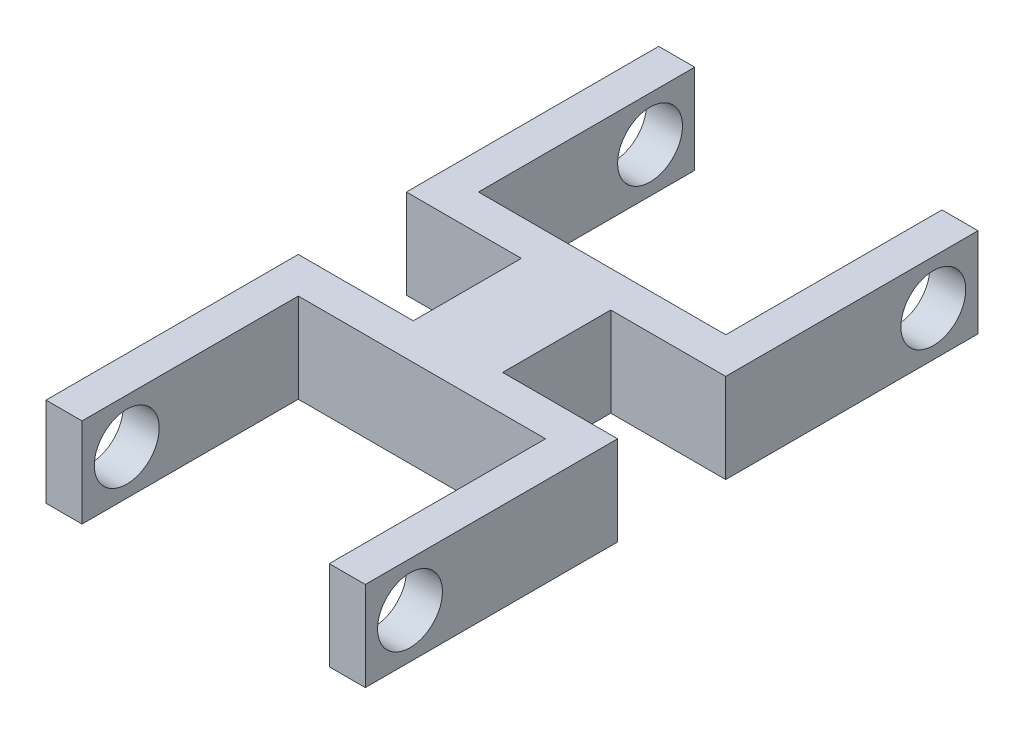
ISO-10303-21;
HEADER;
FILE_DESCRIPTION(('STEP AP214'),'2;1');
FILE_NAME('part.step','',(''),(''),'','','');
FILE_SCHEMA(('AUTOMOTIVE_DESIGN { 1 0 10303 214 1 1 1 1 }'));
ENDSEC;
DATA;
#1=APPLICATION_CONTEXT('core data for automotive mechanical design processes');
#2=APPLICATION_PROTOCOL_DEFINITION('international standard','automotive_design',2000,#1);
#3=PRODUCT_CONTEXT('',#1,'mechanical');
#4=PRODUCT('Part','Part','',(#3));
#5=PRODUCT_RELATED_PRODUCT_CATEGORY('part','',(#4));
#6=PRODUCT_DEFINITION_FORMATION('','',#4);
#7=PRODUCT_DEFINITION_CONTEXT('part definition',#1,'design');
#8=PRODUCT_DEFINITION('design','',#6,#7);
#9=PRODUCT_DEFINITION_SHAPE('','',#8);
#10=(LENGTH_UNIT() NAMED_UNIT(*) SI_UNIT(.MILLI.,.METRE.));
#11=(NAMED_UNIT(*) PLANE_ANGLE_UNIT() SI_UNIT($,.RADIAN.));
#12=(NAMED_UNIT(*) SI_UNIT($,.STERADIAN.) SOLID_ANGLE_UNIT());
#13=UNCERTAINTY_MEASURE_WITH_UNIT(LENGTH_MEASURE(1.E-05),#10,'distance_accuracy_value','');
#14=(GEOMETRIC_REPRESENTATION_CONTEXT(3) GLOBAL_UNCERTAINTY_ASSIGNED_CONTEXT((#13)) GLOBAL_UNIT_ASSIGNED_CONTEXT((#10,
#11,#12)) REPRESENTATION_CONTEXT('',''));
#15=CARTESIAN_POINT('',(0.,0.,0.));
#16=DIRECTION('',(0.,0.,1.));
#17=DIRECTION('',(1.,0.,0.));
#18=AXIS2_PLACEMENT_3D('',#15,#16,#17);
#19=CARTESIAN_POINT('',(0.,0.,-20.));
#20=DIRECTION('',(0.,0.,1.));
#21=DIRECTION('',(1.,0.,0.));
#22=AXIS2_PLACEMENT_3D('',#19,#20,#21);
#23=PLANE('',#22);
#24=DIRECTION('',(0.,-1.,0.));
#25=VECTOR('',#24,1.);
#26=CARTESIAN_POINT('',(-17.15,6.2,-20.));
#27=LINE('',#26,#25);
#28=CARTESIAN_POINT('',(-17.15,6.2,-20.));
#29=VERTEX_POINT('',#28);
#30=CARTESIAN_POINT('',(-17.15,-6.2,-20.));
#31=VERTEX_POINT('',#30);
#32=EDGE_CURVE('E55',#29,#31,#27,.T.);
#33=ORIENTED_EDGE('',*,*,#32,.F.);
#34=DIRECTION('',(1.,0.,0.));
#35=VECTOR('',#34,1.);
#36=CARTESIAN_POINT('',(22.15,6.2,-20.));
#37=LINE('',#36,#35);
#38=CARTESIAN_POINT('',(17.15,6.2,-20.));
#39=VERTEX_POINT('',#38);
#40=EDGE_CURVE('E234',#29,#39,#37,.T.);
#41=ORIENTED_EDGE('',*,*,#40,.T.);
#42=DIRECTION('',(0.,1.,0.));
#43=VECTOR('',#42,1.);
#44=CARTESIAN_POINT('',(17.15,6.2,-20.));
#45=LINE('',#44,#43);
#46=CARTESIAN_POINT('',(17.15,-6.2,-20.));
#47=VERTEX_POINT('',#46);
#48=EDGE_CURVE('E215',#47,#39,#45,.T.);
#49=ORIENTED_EDGE('',*,*,#48,.F.);
#50=DIRECTION('',(-1.,0.,0.));
#51=VECTOR('',#50,1.);
#52=CARTESIAN_POINT('',(22.15,-6.2,-20.));
#53=LINE('',#52,#51);
#54=EDGE_CURVE('E60',#47,#31,#53,.T.);
#55=ORIENTED_EDGE('',*,*,#54,.T.);
#56=EDGE_LOOP('',(#33,#41,#49,#55));
#57=FACE_BOUND('',#56,.T.);
#58=ADVANCED_FACE('F38',(#57),#23,.F.);
#59=CARTESIAN_POINT('',(0.,0.,0.));
#60=DIRECTION('',(0.,0.,1.));
#61=DIRECTION('',(1.,0.,0.));
#62=AXIS2_PLACEMENT_3D('',#59,#60,#61);
#63=PLANE('',#62);
#64=DIRECTION('',(0.,1.,0.));
#65=VECTOR('',#64,1.);
#66=CARTESIAN_POINT('',(-6.2,-6.2,0.));
#67=LINE('',#66,#65);
#68=CARTESIAN_POINT('',(-6.2,-6.2,0.));
#69=VERTEX_POINT('',#68);
#70=CARTESIAN_POINT('',(-6.2,6.2,0.));
#71=VERTEX_POINT('',#70);
#72=EDGE_CURVE('E259',#69,#71,#67,.T.);
#73=ORIENTED_EDGE('',*,*,#72,.F.);
#74=DIRECTION('',(1.,0.,0.));
#75=VECTOR('',#74,1.);
#76=CARTESIAN_POINT('',(-22.15,-6.2,0.));
#77=LINE('',#76,#75);
#78=CARTESIAN_POINT('',(-22.15,-6.2,0.));
#79=VERTEX_POINT('',#78);
#80=EDGE_CURVE('E329',#79,#69,#77,.T.);
#81=ORIENTED_EDGE('',*,*,#80,.F.);
#82=DIRECTION('',(0.,-1.,0.));
#83=VECTOR('',#82,1.);
#84=CARTESIAN_POINT('',(-22.15,6.2,0.));
#85=LINE('',#84,#83);
#86=CARTESIAN_POINT('',(-22.15,6.2,0.));
#87=VERTEX_POINT('',#86);
#88=EDGE_CURVE('E337',#87,#79,#85,.T.);
#89=ORIENTED_EDGE('',*,*,#88,.F.);
#90=DIRECTION('',(-1.,0.,0.));
#91=VECTOR('',#90,1.);
#92=CARTESIAN_POINT('',(-22.15,6.2,0.));
#93=LINE('',#92,#91);
#94=EDGE_CURVE('E334',#71,#87,#93,.T.);
#95=ORIENTED_EDGE('',*,*,#94,.F.);
#96=EDGE_LOOP('',(#73,#81,#89,#95));
#97=FACE_BOUND('',#96,.T.);
#98=ADVANCED_FACE('F374',(#97),#63,.F.);
#99=DIRECTION('',(0.,-1.,0.));
#100=VECTOR('',#99,1.);
#101=CARTESIAN_POINT('',(6.2,-6.2,0.));
#102=LINE('',#101,#100);
#103=CARTESIAN_POINT('',(6.2,6.2,0.));
#104=VERTEX_POINT('',#103);
#105=CARTESIAN_POINT('',(6.2,-6.2,0.));
#106=VERTEX_POINT('',#105);
#107=EDGE_CURVE('E262',#104,#106,#102,.T.);
#108=ORIENTED_EDGE('',*,*,#107,.F.);
#109=CARTESIAN_POINT('',(22.15,6.2,0.));
#110=VERTEX_POINT('',#109);
#111=EDGE_CURVE('E335',#110,#104,#93,.T.);
#112=ORIENTED_EDGE('',*,*,#111,.F.);
#113=DIRECTION('',(0.,1.,0.));
#114=VECTOR('',#113,1.);
#115=CARTESIAN_POINT('',(22.15,6.2,0.));
#116=LINE('',#115,#114);
#117=CARTESIAN_POINT('',(22.15,-6.2,0.));
#118=VERTEX_POINT('',#117);
#119=EDGE_CURVE('E325',#118,#110,#116,.T.);
#120=ORIENTED_EDGE('',*,*,#119,.F.);
#121=EDGE_CURVE('E339',#106,#118,#77,.T.);
#122=ORIENTED_EDGE('',*,*,#121,.F.);
#123=EDGE_LOOP('',(#108,#112,#120,#122));
#124=FACE_BOUND('',#123,.T.);
#125=ADVANCED_FACE('F400',(#124),#63,.F.);
#126=CARTESIAN_POINT('',(0.,0.,5.));
#127=DIRECTION('',(0.,0.,1.));
#128=DIRECTION('',(1.,0.,0.));
#129=AXIS2_PLACEMENT_3D('',#126,#127,#128);
#130=PLANE('',#129);
#131=DIRECTION('',(-1.,0.,0.));
#132=VECTOR('',#131,1.);
#133=CARTESIAN_POINT('',(-22.15,6.2,5.));
#134=LINE('',#133,#132);
#135=CARTESIAN_POINT('',(17.15,6.2,5.));
#136=VERTEX_POINT('',#135);
#137=CARTESIAN_POINT('',(-17.15,6.2,5.));
#138=VERTEX_POINT('',#137);
#139=EDGE_CURVE('E326',#136,#138,#134,.T.);
#140=ORIENTED_EDGE('',*,*,#139,.T.);
#141=DIRECTION('',(0.,1.,0.));
#142=VECTOR('',#141,1.);
#143=CARTESIAN_POINT('',(-17.15,6.2,5.));
#144=LINE('',#143,#142);
#145=CARTESIAN_POINT('',(-17.15,-6.2,5.));
#146=VERTEX_POINT('',#145);
#147=EDGE_CURVE('E287',#146,#138,#144,.T.);
#148=ORIENTED_EDGE('',*,*,#147,.F.);
#149=DIRECTION('',(1.,0.,0.));
#150=VECTOR('',#149,1.);
#151=CARTESIAN_POINT('',(-22.15,-6.2,5.));
#152=LINE('',#151,#150);
#153=CARTESIAN_POINT('',(17.15,-6.2,5.));
#154=VERTEX_POINT('',#153);
#155=EDGE_CURVE('E328',#146,#154,#152,.T.);
#156=ORIENTED_EDGE('',*,*,#155,.T.);
#157=DIRECTION('',(0.,-1.,0.));
#158=VECTOR('',#157,1.);
#159=CARTESIAN_POINT('',(17.15,6.2,5.));
#160=LINE('',#159,#158);
#161=EDGE_CURVE('E306',#136,#154,#160,.T.);
#162=ORIENTED_EDGE('',*,*,#161,.F.);
#163=EDGE_LOOP('',(#140,#148,#156,#162));
#164=FACE_BOUND('',#163,.T.);
#165=ADVANCED_FACE('F464',(#164),#130,.T.);
#166=CARTESIAN_POINT('',(22.15,6.2,5.));
#167=DIRECTION('',(-1.,0.,0.));
#168=DIRECTION('',(0.,0.,1.));
#169=AXIS2_PLACEMENT_3D('',#166,#167,#168);
#170=PLANE('',#169);
#171=CARTESIAN_POINT('',(22.15,0.,28.8));
#172=DIRECTION('',(1.,0.,0.));
#173=DIRECTION('',(0.,0.,-1.));
#174=AXIS2_PLACEMENT_3D('',#171,#172,#173);
#175=CIRCLE('',#174,4.5);
#176=CARTESIAN_POINT('',(22.15,0.,24.3));
#177=VERTEX_POINT('',#176);
#178=EDGE_CURVE('E277',#177,#177,#175,.T.);
#179=ORIENTED_EDGE('',*,*,#178,.F.);
#180=EDGE_LOOP('',(#179));
#181=FACE_BOUND('',#180,.T.);
#182=ORIENTED_EDGE('',*,*,#119,.T.);
#183=DIRECTION('',(0.,0.,-1.));
#184=VECTOR('',#183,1.);
#185=CARTESIAN_POINT('',(22.15,6.2,5.));
#186=LINE('',#185,#184);
#187=CARTESIAN_POINT('',(22.15,6.2,35.));
#188=VERTEX_POINT('',#187);
#189=EDGE_CURVE('E11',#188,#110,#186,.T.);
#190=ORIENTED_EDGE('',*,*,#189,.F.);
#191=DIRECTION('',(0.,1.,0.));
#192=VECTOR('',#191,1.);
#193=CARTESIAN_POINT('',(22.15,6.2,35.));
#194=LINE('',#193,#192);
#195=CARTESIAN_POINT('',(22.15,-6.2,35.));
#196=VERTEX_POINT('',#195);
#197=EDGE_CURVE('E307',#196,#188,#194,.T.);
#198=ORIENTED_EDGE('',*,*,#197,.F.);
#199=DIRECTION('',(0.,0.,-1.));
#200=VECTOR('',#199,1.);
#201=CARTESIAN_POINT('',(22.15,-6.2,5.));
#202=LINE('',#201,#200);
#203=EDGE_CURVE('E331',#196,#118,#202,.T.);
#204=ORIENTED_EDGE('',*,*,#203,.T.);
#205=EDGE_LOOP('',(#182,#190,#198,#204));
#206=FACE_BOUND('',#205,.T.);
#207=ADVANCED_FACE('F40',(#181,#206),#170,.F.);
#208=CARTESIAN_POINT('',(-22.15,6.2,5.));
#209=DIRECTION('',(0.,-1.,0.));
#210=DIRECTION('',(0.,0.,-1.));
#211=AXIS2_PLACEMENT_3D('',#208,#209,#210);
#212=PLANE('',#211);
#213=ORIENTED_EDGE('',*,*,#111,.T.);
#214=DIRECTION('',(0.,0.,1.));
#215=VECTOR('',#214,1.);
#216=CARTESIAN_POINT('',(6.2,6.2,-7.5));
#217=LINE('',#216,#215);
#218=CARTESIAN_POINT('',(6.2,6.2,-15.));
#219=VERTEX_POINT('',#218);
#220=EDGE_CURVE('E271',#219,#104,#217,.T.);
#221=ORIENTED_EDGE('',*,*,#220,.F.);
#222=DIRECTION('',(1.,0.,0.));
#223=VECTOR('',#222,1.);
#224=CARTESIAN_POINT('',(22.15,6.2,-15.));
#225=LINE('',#224,#223);
#226=CARTESIAN_POINT('',(22.15,6.2,-15.));
#227=VERTEX_POINT('',#226);
#228=EDGE_CURVE('E240',#219,#227,#225,.T.);
#229=ORIENTED_EDGE('',*,*,#228,.T.);
#230=DIRECTION('',(0.,0.,1.));
#231=VECTOR('',#230,1.);
#232=CARTESIAN_POINT('',(22.15,6.2,-20.));
#233=LINE('',#232,#231);
#234=CARTESIAN_POINT('',(22.15,6.2,-50.));
#235=VERTEX_POINT('',#234);
#236=EDGE_CURVE('E187',#235,#227,#233,.T.);
#237=ORIENTED_EDGE('',*,*,#236,.F.);
#238=DIRECTION('',(1.,0.,0.));
#239=VECTOR('',#238,1.);
#240=CARTESIAN_POINT('',(22.15,6.2,-50.));
#241=LINE('',#240,#239);
#242=CARTESIAN_POINT('',(17.15,6.2,-50.));
#243=VERTEX_POINT('',#242);
#244=EDGE_CURVE('E223',#243,#235,#241,.T.);
#245=ORIENTED_EDGE('',*,*,#244,.F.);
#246=DIRECTION('',(0.,0.,1.));
#247=VECTOR('',#246,1.);
#248=CARTESIAN_POINT('',(17.15,6.2,-50.));
#249=LINE('',#248,#247);
#250=EDGE_CURVE('E226',#243,#39,#249,.T.);
#251=ORIENTED_EDGE('',*,*,#250,.T.);
#252=ORIENTED_EDGE('',*,*,#40,.F.);
#253=DIRECTION('',(0.,0.,1.));
#254=VECTOR('',#253,1.);
#255=CARTESIAN_POINT('',(-17.15,6.2,-50.));
#256=LINE('',#255,#254);
#257=CARTESIAN_POINT('',(-17.15,6.2,-50.));
#258=VERTEX_POINT('',#257);
#259=EDGE_CURVE('E194',#258,#29,#256,.T.);
#260=ORIENTED_EDGE('',*,*,#259,.F.);
#261=DIRECTION('',(1.,0.,0.));
#262=VECTOR('',#261,1.);
#263=CARTESIAN_POINT('',(-22.15,6.2,-50.));
#264=LINE('',#263,#262);
#265=CARTESIAN_POINT('',(-22.15,6.2,-50.));
#266=VERTEX_POINT('',#265);
#267=EDGE_CURVE('E190',#266,#258,#264,.T.);
#268=ORIENTED_EDGE('',*,*,#267,.F.);
#269=DIRECTION('',(0.,0.,1.));
#270=VECTOR('',#269,1.);
#271=CARTESIAN_POINT('',(-22.15,6.2,-20.));
#272=LINE('',#271,#270);
#273=CARTESIAN_POINT('',(-22.15,6.2,-15.));
#274=VERTEX_POINT('',#273);
#275=EDGE_CURVE('E176',#266,#274,#272,.T.);
#276=ORIENTED_EDGE('',*,*,#275,.T.);
#277=CARTESIAN_POINT('',(-6.2,6.2,-15.));
#278=VERTEX_POINT('',#277);
#279=EDGE_CURVE('E241',#274,#278,#225,.T.);
#280=ORIENTED_EDGE('',*,*,#279,.T.);
#281=DIRECTION('',(0.,0.,1.));
#282=VECTOR('',#281,1.);
#283=CARTESIAN_POINT('',(-6.2,6.2,-7.5));
#284=LINE('',#283,#282);
#285=EDGE_CURVE('E274',#278,#71,#284,.T.);
#286=ORIENTED_EDGE('',*,*,#285,.T.);
#287=ORIENTED_EDGE('',*,*,#94,.T.);
#288=DIRECTION('',(0.,0.,-1.));
#289=VECTOR('',#288,1.);
#290=CARTESIAN_POINT('',(-22.15,6.2,5.));
#291=LINE('',#290,#289);
#292=CARTESIAN_POINT('',(-22.15,6.2,35.));
#293=VERTEX_POINT('',#292);
#294=EDGE_CURVE('E47',#293,#87,#291,.T.);
#295=ORIENTED_EDGE('',*,*,#294,.F.);
#296=DIRECTION('',(-1.,0.,0.));
#297=VECTOR('',#296,1.);
#298=CARTESIAN_POINT('',(-22.15,6.2,35.));
#299=LINE('',#298,#297);
#300=CARTESIAN_POINT('',(-17.15,6.2,35.));
#301=VERTEX_POINT('',#300);
#302=EDGE_CURVE('E295',#301,#293,#299,.T.);
#303=ORIENTED_EDGE('',*,*,#302,.F.);
#304=DIRECTION('',(0.,0.,-1.));
#305=VECTOR('',#304,1.);
#306=CARTESIAN_POINT('',(-17.15,6.2,35.));
#307=LINE('',#306,#305);
#308=EDGE_CURVE('E298',#301,#138,#307,.T.);
#309=ORIENTED_EDGE('',*,*,#308,.T.);
#310=ORIENTED_EDGE('',*,*,#139,.F.);
#311=DIRECTION('',(0.,0.,-1.));
#312=VECTOR('',#311,1.);
#313=CARTESIAN_POINT('',(17.15,6.2,35.));
#314=LINE('',#313,#312);
#315=CARTESIAN_POINT('',(17.15,6.2,35.));
#316=VERTEX_POINT('',#315);
#317=EDGE_CURVE('E322',#316,#136,#314,.T.);
#318=ORIENTED_EDGE('',*,*,#317,.F.);
#319=DIRECTION('',(-1.,0.,0.));
#320=VECTOR('',#319,1.);
#321=CARTESIAN_POINT('',(22.15,6.2,35.));
#322=LINE('',#321,#320);
#323=EDGE_CURVE('E310',#188,#316,#322,.T.);
#324=ORIENTED_EDGE('',*,*,#323,.F.);
#325=ORIENTED_EDGE('',*,*,#189,.T.);
#326=EDGE_LOOP('',(#213,#221,#229,#237,#245,#251,#252,#260,#268,#276,#280,#286,#287,#295,#303,
#309,#310,#318,#324,#325));
#327=FACE_BOUND('',#326,.T.);
#328=ADVANCED_FACE('F192',(#327),#212,.F.);
#329=CARTESIAN_POINT('',(-22.15,6.2,5.));
#330=DIRECTION('',(1.,0.,0.));
#331=DIRECTION('',(0.,1.,0.));
#332=AXIS2_PLACEMENT_3D('',#329,#330,#331);
#333=PLANE('',#332);
#334=CARTESIAN_POINT('',(-22.15,0.,28.8));
#335=DIRECTION('',(1.,0.,0.));
#336=DIRECTION('',(0.,1.,0.));
#337=AXIS2_PLACEMENT_3D('',#334,#335,#336);
#338=CIRCLE('',#337,4.5);
#339=CARTESIAN_POINT('',(-22.15,4.5,28.8));
#340=VERTEX_POINT('',#339);
#341=EDGE_CURVE('E284',#340,#340,#338,.T.);
#342=ORIENTED_EDGE('',*,*,#341,.T.);
#343=EDGE_LOOP('',(#342));
#344=FACE_BOUND('',#343,.T.);
#345=ORIENTED_EDGE('',*,*,#88,.T.);
#346=DIRECTION('',(0.,0.,-1.));
#347=VECTOR('',#346,1.);
#348=CARTESIAN_POINT('',(-22.15,-6.2,5.));
#349=LINE('',#348,#347);
#350=CARTESIAN_POINT('',(-22.15,-6.2,35.));
#351=VERTEX_POINT('',#350);
#352=EDGE_CURVE('E344',#351,#79,#349,.T.);
#353=ORIENTED_EDGE('',*,*,#352,.F.);
#354=DIRECTION('',(0.,-1.,0.));
#355=VECTOR('',#354,1.);
#356=CARTESIAN_POINT('',(-22.15,6.2,35.));
#357=LINE('',#356,#355);
#358=EDGE_CURVE('E288',#293,#351,#357,.T.);
#359=ORIENTED_EDGE('',*,*,#358,.F.);
#360=ORIENTED_EDGE('',*,*,#294,.T.);
#361=EDGE_LOOP('',(#345,#353,#359,#360));
#362=FACE_BOUND('',#361,.T.);
#363=ADVANCED_FACE('F362',(#344,#362),#333,.F.);
#364=CARTESIAN_POINT('',(-22.15,-6.2,5.));
#365=DIRECTION('',(0.,1.,0.));
#366=DIRECTION('',(0.,0.,1.));
#367=AXIS2_PLACEMENT_3D('',#364,#365,#366);
#368=PLANE('',#367);
#369=ORIENTED_EDGE('',*,*,#80,.T.);
#370=DIRECTION('',(0.,0.,1.));
#371=VECTOR('',#370,1.);
#372=CARTESIAN_POINT('',(-6.2,-6.2,-7.5));
#373=LINE('',#372,#371);
#374=CARTESIAN_POINT('',(-6.2,-6.2,-15.));
#375=VERTEX_POINT('',#374);
#376=EDGE_CURVE('E265',#375,#69,#373,.T.);
#377=ORIENTED_EDGE('',*,*,#376,.F.);
#378=DIRECTION('',(-1.,0.,0.));
#379=VECTOR('',#378,1.);
#380=CARTESIAN_POINT('',(22.15,-6.2,-15.));
#381=LINE('',#380,#379);
#382=CARTESIAN_POINT('',(-22.15,-6.2,-15.));
#383=VERTEX_POINT('',#382);
#384=EDGE_CURVE('E245',#375,#383,#381,.T.);
#385=ORIENTED_EDGE('',*,*,#384,.T.);
#386=DIRECTION('',(0.,0.,1.));
#387=VECTOR('',#386,1.);
#388=CARTESIAN_POINT('',(-22.15,-6.2,-20.));
#389=LINE('',#388,#387);
#390=CARTESIAN_POINT('',(-22.15,-6.2,-50.));
#391=VERTEX_POINT('',#390);
#392=EDGE_CURVE('E238',#391,#383,#389,.T.);
#393=ORIENTED_EDGE('',*,*,#392,.F.);
#394=DIRECTION('',(-1.,0.,0.));
#395=VECTOR('',#394,1.);
#396=CARTESIAN_POINT('',(-22.15,-6.2,-50.));
#397=LINE('',#396,#395);
#398=CARTESIAN_POINT('',(-17.15,-6.2,-50.));
#399=VERTEX_POINT('',#398);
#400=EDGE_CURVE('E202',#399,#391,#397,.T.);
#401=ORIENTED_EDGE('',*,*,#400,.F.);
#402=DIRECTION('',(0.,0.,1.));
#403=VECTOR('',#402,1.);
#404=CARTESIAN_POINT('',(-17.15,-6.2,-50.));
#405=LINE('',#404,#403);
#406=EDGE_CURVE('E210',#399,#31,#405,.T.);
#407=ORIENTED_EDGE('',*,*,#406,.T.);
#408=ORIENTED_EDGE('',*,*,#54,.F.);
#409=DIRECTION('',(0.,0.,1.));
#410=VECTOR('',#409,1.);
#411=CARTESIAN_POINT('',(17.15,-6.2,-50.));
#412=LINE('',#411,#410);
#413=CARTESIAN_POINT('',(17.15,-6.2,-50.));
#414=VERTEX_POINT('',#413);
#415=EDGE_CURVE('E231',#414,#47,#412,.T.);
#416=ORIENTED_EDGE('',*,*,#415,.F.);
#417=DIRECTION('',(-1.,0.,0.));
#418=VECTOR('',#417,1.);
#419=CARTESIAN_POINT('',(22.15,-6.2,-50.));
#420=LINE('',#419,#418);
#421=CARTESIAN_POINT('',(22.15,-6.2,-50.));
#422=VERTEX_POINT('',#421);
#423=EDGE_CURVE('E219',#422,#414,#420,.T.);
#424=ORIENTED_EDGE('',*,*,#423,.F.);
#425=DIRECTION('',(0.,0.,1.));
#426=VECTOR('',#425,1.);
#427=CARTESIAN_POINT('',(22.15,-6.2,-20.));
#428=LINE('',#427,#426);
#429=CARTESIAN_POINT('',(22.15,-6.2,-15.));
#430=VERTEX_POINT('',#429);
#431=EDGE_CURVE('E249',#422,#430,#428,.T.);
#432=ORIENTED_EDGE('',*,*,#431,.T.);
#433=CARTESIAN_POINT('',(6.2,-6.2,-15.));
#434=VERTEX_POINT('',#433);
#435=EDGE_CURVE('E236',#430,#434,#381,.T.);
#436=ORIENTED_EDGE('',*,*,#435,.T.);
#437=DIRECTION('',(0.,0.,1.));
#438=VECTOR('',#437,1.);
#439=CARTESIAN_POINT('',(6.2,-6.2,-7.5));
#440=LINE('',#439,#438);
#441=EDGE_CURVE('E268',#434,#106,#440,.T.);
#442=ORIENTED_EDGE('',*,*,#441,.T.);
#443=ORIENTED_EDGE('',*,*,#121,.T.);
#444=ORIENTED_EDGE('',*,*,#203,.F.);
#445=DIRECTION('',(1.,0.,0.));
#446=VECTOR('',#445,1.);
#447=CARTESIAN_POINT('',(22.15,-6.2,35.));
#448=LINE('',#447,#446);
#449=CARTESIAN_POINT('',(17.15,-6.2,35.));
#450=VERTEX_POINT('',#449);
#451=EDGE_CURVE('E314',#450,#196,#448,.T.);
#452=ORIENTED_EDGE('',*,*,#451,.F.);
#453=DIRECTION('',(0.,0.,-1.));
#454=VECTOR('',#453,1.);
#455=CARTESIAN_POINT('',(17.15,-6.2,35.));
#456=LINE('',#455,#454);
#457=EDGE_CURVE('E317',#450,#154,#456,.T.);
#458=ORIENTED_EDGE('',*,*,#457,.T.);
#459=ORIENTED_EDGE('',*,*,#155,.F.);
#460=DIRECTION('',(0.,0.,-1.));
#461=VECTOR('',#460,1.);
#462=CARTESIAN_POINT('',(-17.15,-6.2,35.));
#463=LINE('',#462,#461);
#464=CARTESIAN_POINT('',(-17.15,-6.2,35.));
#465=VERTEX_POINT('',#464);
#466=EDGE_CURVE('E303',#465,#146,#463,.T.);
#467=ORIENTED_EDGE('',*,*,#466,.F.);
#468=DIRECTION('',(1.,0.,0.));
#469=VECTOR('',#468,1.);
#470=CARTESIAN_POINT('',(-22.15,-6.2,35.));
#471=LINE('',#470,#469);
#472=EDGE_CURVE('E291',#351,#465,#471,.T.);
#473=ORIENTED_EDGE('',*,*,#472,.F.);
#474=ORIENTED_EDGE('',*,*,#352,.T.);
#475=EDGE_LOOP('',(#369,#377,#385,#393,#401,#407,#408,#416,#424,#432,#436,#442,#443,#444,#452,
#458,#459,#467,#473,#474));
#476=FACE_BOUND('',#475,.T.);
#477=ADVANCED_FACE('F365',(#476),#368,.F.);
#478=CARTESIAN_POINT('',(17.15,6.2,35.));
#479=DIRECTION('',(1.,0.,0.));
#480=DIRECTION('',(0.,0.,-1.));
#481=AXIS2_PLACEMENT_3D('',#478,#479,#480);
#482=PLANE('',#481);
#483=CARTESIAN_POINT('',(17.15,0.,28.8));
#484=DIRECTION('',(1.,0.,0.));
#485=DIRECTION('',(0.,0.,-1.));
#486=AXIS2_PLACEMENT_3D('',#483,#484,#485);
#487=CIRCLE('',#486,4.5);
#488=CARTESIAN_POINT('',(17.15,0.,24.3));
#489=VERTEX_POINT('',#488);
#490=EDGE_CURVE('E281',#489,#489,#487,.T.);
#491=ORIENTED_EDGE('',*,*,#490,.T.);
#492=EDGE_LOOP('',(#491));
#493=FACE_BOUND('',#492,.T.);
#494=ORIENTED_EDGE('',*,*,#161,.T.);
#495=ORIENTED_EDGE('',*,*,#457,.F.);
#496=DIRECTION('',(0.,-1.,0.));
#497=VECTOR('',#496,1.);
#498=CARTESIAN_POINT('',(17.15,6.2,35.));
#499=LINE('',#498,#497);
#500=EDGE_CURVE('E312',#316,#450,#499,.T.);
#501=ORIENTED_EDGE('',*,*,#500,.F.);
#502=ORIENTED_EDGE('',*,*,#317,.T.);
#503=EDGE_LOOP('',(#494,#495,#501,#502));
#504=FACE_BOUND('',#503,.T.);
#505=ADVANCED_FACE('F391',(#493,#504),#482,.F.);
#506=CARTESIAN_POINT('',(0.,0.,35.));
#507=DIRECTION('',(0.,0.,-1.));
#508=DIRECTION('',(-1.,0.,0.));
#509=AXIS2_PLACEMENT_3D('',#506,#507,#508);
#510=PLANE('',#509);
#511=ORIENTED_EDGE('',*,*,#197,.T.);
#512=ORIENTED_EDGE('',*,*,#323,.T.);
#513=ORIENTED_EDGE('',*,*,#500,.T.);
#514=ORIENTED_EDGE('',*,*,#451,.T.);
#515=EDGE_LOOP('',(#511,#512,#513,#514));
#516=FACE_BOUND('',#515,.T.);
#517=ADVANCED_FACE('F395',(#516),#510,.F.);
#518=CARTESIAN_POINT('',(-17.15,6.2,35.));
#519=DIRECTION('',(-1.,0.,0.));
#520=DIRECTION('',(0.,0.,1.));
#521=AXIS2_PLACEMENT_3D('',#518,#519,#520);
#522=PLANE('',#521);
#523=CARTESIAN_POINT('',(-17.15,0.,28.8));
#524=DIRECTION('',(-1.,0.,0.));
#525=DIRECTION('',(0.,0.,1.));
#526=AXIS2_PLACEMENT_3D('',#523,#524,#525);
#527=CIRCLE('',#526,4.5);
#528=CARTESIAN_POINT('',(-17.15,0.,33.3));
#529=VERTEX_POINT('',#528);
#530=EDGE_CURVE('E280',#529,#529,#527,.T.);
#531=ORIENTED_EDGE('',*,*,#530,.T.);
#532=EDGE_LOOP('',(#531));
#533=FACE_BOUND('',#532,.T.);
#534=ORIENTED_EDGE('',*,*,#147,.T.);
#535=ORIENTED_EDGE('',*,*,#308,.F.);
#536=DIRECTION('',(0.,1.,0.));
#537=VECTOR('',#536,1.);
#538=CARTESIAN_POINT('',(-17.15,6.2,35.));
#539=LINE('',#538,#537);
#540=EDGE_CURVE('E293',#465,#301,#539,.T.);
#541=ORIENTED_EDGE('',*,*,#540,.F.);
#542=ORIENTED_EDGE('',*,*,#466,.T.);
#543=EDGE_LOOP('',(#534,#535,#541,#542));
#544=FACE_BOUND('',#543,.T.);
#545=ADVANCED_FACE('F351',(#533,#544),#522,.F.);
#546=CARTESIAN_POINT('',(0.,0.,35.));
#547=DIRECTION('',(0.,0.,1.));
#548=DIRECTION('',(1.,0.,0.));
#549=AXIS2_PLACEMENT_3D('',#546,#547,#548);
#550=PLANE('',#549);
#551=ORIENTED_EDGE('',*,*,#358,.T.);
#552=ORIENTED_EDGE('',*,*,#472,.T.);
#553=ORIENTED_EDGE('',*,*,#540,.T.);
#554=ORIENTED_EDGE('',*,*,#302,.T.);
#555=EDGE_LOOP('',(#551,#552,#553,#554));
#556=FACE_BOUND('',#555,.T.);
#557=ADVANCED_FACE('F358',(#556),#550,.T.);
#558=CARTESIAN_POINT('',(-27.85,0.,28.8));
#559=DIRECTION('',(1.,0.,0.));
#560=DIRECTION('',(0.,0.,-1.));
#561=AXIS2_PLACEMENT_3D('',#558,#559,#560);
#562=CYLINDRICAL_SURFACE('',#561,4.5);
#563=ORIENTED_EDGE('',*,*,#530,.F.);
#564=EDGE_LOOP('',(#563));
#565=FACE_BOUND('',#564,.T.);
#566=ORIENTED_EDGE('',*,*,#341,.F.);
#567=EDGE_LOOP('',(#566));
#568=FACE_BOUND('',#567,.T.);
#569=ADVANCED_FACE('F354',(#565,#568),#562,.F.);
#570=ORIENTED_EDGE('',*,*,#178,.T.);
#571=EDGE_LOOP('',(#570));
#572=FACE_BOUND('',#571,.T.);
#573=ORIENTED_EDGE('',*,*,#490,.F.);
#574=EDGE_LOOP('',(#573));
#575=FACE_BOUND('',#574,.T.);
#576=ADVANCED_FACE('F357',(#572,#575),#562,.F.);
#577=CARTESIAN_POINT('',(-6.2,-6.2,-7.5));
#578=DIRECTION('',(1.,0.,0.));
#579=DIRECTION('',(0.,0.,-1.));
#580=AXIS2_PLACEMENT_3D('',#577,#578,#579);
#581=PLANE('',#580);
#582=ORIENTED_EDGE('',*,*,#72,.T.);
#583=ORIENTED_EDGE('',*,*,#285,.F.);
#584=DIRECTION('',(0.,1.,0.));
#585=VECTOR('',#584,1.);
#586=CARTESIAN_POINT('',(-6.2,-6.2,-15.));
#587=LINE('',#586,#585);
#588=EDGE_CURVE('E186',#375,#278,#587,.T.);
#589=ORIENTED_EDGE('',*,*,#588,.F.);
#590=ORIENTED_EDGE('',*,*,#376,.T.);
#591=EDGE_LOOP('',(#582,#583,#589,#590));
#592=FACE_BOUND('',#591,.T.);
#593=ADVANCED_FACE('F376',(#592),#581,.F.);
#594=CARTESIAN_POINT('',(6.2,-6.2,-7.5));
#595=DIRECTION('',(-1.,0.,0.));
#596=DIRECTION('',(0.,0.,1.));
#597=AXIS2_PLACEMENT_3D('',#594,#595,#596);
#598=PLANE('',#597);
#599=ORIENTED_EDGE('',*,*,#107,.T.);
#600=ORIENTED_EDGE('',*,*,#441,.F.);
#601=DIRECTION('',(0.,-1.,0.));
#602=VECTOR('',#601,1.);
#603=CARTESIAN_POINT('',(6.2,-6.2,-15.));
#604=LINE('',#603,#602);
#605=EDGE_CURVE('E256',#219,#434,#604,.T.);
#606=ORIENTED_EDGE('',*,*,#605,.F.);
#607=ORIENTED_EDGE('',*,*,#220,.T.);
#608=EDGE_LOOP('',(#599,#600,#606,#607));
#609=FACE_BOUND('',#608,.T.);
#610=ADVANCED_FACE('F402',(#609),#598,.F.);
#611=CARTESIAN_POINT('',(0.,0.,-15.));
#612=DIRECTION('',(0.,0.,1.));
#613=DIRECTION('',(1.,0.,0.));
#614=AXIS2_PLACEMENT_3D('',#611,#612,#613);
#615=PLANE('',#614);
#616=ORIENTED_EDGE('',*,*,#384,.F.);
#617=ORIENTED_EDGE('',*,*,#588,.T.);
#618=ORIENTED_EDGE('',*,*,#279,.F.);
#619=DIRECTION('',(0.,1.,0.));
#620=VECTOR('',#619,1.);
#621=CARTESIAN_POINT('',(-22.15,-6.2,-15.));
#622=LINE('',#621,#620);
#623=EDGE_CURVE('E183',#383,#274,#622,.T.);
#624=ORIENTED_EDGE('',*,*,#623,.F.);
#625=EDGE_LOOP('',(#616,#617,#618,#624));
#626=FACE_BOUND('',#625,.T.);
#627=ADVANCED_FACE('F380',(#626),#615,.T.);
#628=CARTESIAN_POINT('',(-22.15,-6.2,-20.));
#629=DIRECTION('',(1.,0.,0.));
#630=DIRECTION('',(0.,0.,-1.));
#631=AXIS2_PLACEMENT_3D('',#628,#629,#630);
#632=PLANE('',#631);
#633=CARTESIAN_POINT('',(-22.15,0.,-43.8));
#634=DIRECTION('',(-1.,0.,0.));
#635=DIRECTION('',(0.,0.,1.));
#636=AXIS2_PLACEMENT_3D('',#633,#634,#635);
#637=CIRCLE('',#636,4.5);
#638=CARTESIAN_POINT('',(-22.15,0.,-39.3));
#639=VERTEX_POINT('',#638);
#640=EDGE_CURVE('E559',#639,#639,#637,.T.);
#641=ORIENTED_EDGE('',*,*,#640,.F.);
#642=EDGE_LOOP('',(#641));
#643=FACE_BOUND('',#642,.T.);
#644=ORIENTED_EDGE('',*,*,#623,.T.);
#645=ORIENTED_EDGE('',*,*,#275,.F.);
#646=DIRECTION('',(0.,1.,0.));
#647=VECTOR('',#646,1.);
#648=CARTESIAN_POINT('',(-22.15,6.2,-50.));
#649=LINE('',#648,#647);
#650=EDGE_CURVE('E181',#391,#266,#649,.T.);
#651=ORIENTED_EDGE('',*,*,#650,.F.);
#652=ORIENTED_EDGE('',*,*,#392,.T.);
#653=EDGE_LOOP('',(#644,#645,#651,#652));
#654=FACE_BOUND('',#653,.T.);
#655=ADVANCED_FACE('F178',(#643,#654),#632,.F.);
#656=CARTESIAN_POINT('',(22.15,-6.2,-20.));
#657=DIRECTION('',(-1.,0.,0.));
#658=DIRECTION('',(0.,0.,1.));
#659=AXIS2_PLACEMENT_3D('',#656,#657,#658);
#660=PLANE('',#659);
#661=CARTESIAN_POINT('',(22.15,0.,-43.8));
#662=DIRECTION('',(-1.,0.,0.));
#663=DIRECTION('',(0.,0.,1.));
#664=AXIS2_PLACEMENT_3D('',#661,#662,#663);
#665=CIRCLE('',#664,4.5);
#666=CARTESIAN_POINT('',(22.15,0.,-39.3));
#667=VERTEX_POINT('',#666);
#668=EDGE_CURVE('E204',#667,#667,#665,.T.);
#669=ORIENTED_EDGE('',*,*,#668,.T.);
#670=EDGE_LOOP('',(#669));
#671=FACE_BOUND('',#670,.T.);
#672=DIRECTION('',(0.,-1.,0.));
#673=VECTOR('',#672,1.);
#674=CARTESIAN_POINT('',(22.15,-6.2,-15.));
#675=LINE('',#674,#673);
#676=EDGE_CURVE('E243',#227,#430,#675,.T.);
#677=ORIENTED_EDGE('',*,*,#676,.T.);
#678=ORIENTED_EDGE('',*,*,#431,.F.);
#679=DIRECTION('',(0.,-1.,0.));
#680=VECTOR('',#679,1.);
#681=CARTESIAN_POINT('',(22.15,6.2,-50.));
#682=LINE('',#681,#680);
#683=EDGE_CURVE('E216',#235,#422,#682,.T.);
#684=ORIENTED_EDGE('',*,*,#683,.F.);
#685=ORIENTED_EDGE('',*,*,#236,.T.);
#686=EDGE_LOOP('',(#677,#678,#684,#685));
#687=FACE_BOUND('',#686,.T.);
#688=ADVANCED_FACE('F413',(#671,#687),#660,.F.);
#689=ORIENTED_EDGE('',*,*,#228,.F.);
#690=ORIENTED_EDGE('',*,*,#605,.T.);
#691=ORIENTED_EDGE('',*,*,#435,.F.);
#692=ORIENTED_EDGE('',*,*,#676,.F.);
#693=EDGE_LOOP('',(#689,#690,#691,#692));
#694=FACE_BOUND('',#693,.T.);
#695=ADVANCED_FACE('F409',(#694),#615,.T.);
#696=CARTESIAN_POINT('',(17.15,6.2,-50.));
#697=DIRECTION('',(1.,0.,0.));
#698=DIRECTION('',(0.,0.,-1.));
#699=AXIS2_PLACEMENT_3D('',#696,#697,#698);
#700=PLANE('',#699);
#701=CARTESIAN_POINT('',(17.15,0.,-43.8));
#702=DIRECTION('',(1.,0.,0.));
#703=DIRECTION('',(0.,0.,-1.));
#704=AXIS2_PLACEMENT_3D('',#701,#702,#703);
#705=CIRCLE('',#704,4.5);
#706=CARTESIAN_POINT('',(17.15,0.,-48.3));
#707=VERTEX_POINT('',#706);
#708=EDGE_CURVE('E556',#707,#707,#705,.T.);
#709=ORIENTED_EDGE('',*,*,#708,.T.);
#710=EDGE_LOOP('',(#709));
#711=FACE_BOUND('',#710,.T.);
#712=ORIENTED_EDGE('',*,*,#48,.T.);
#713=ORIENTED_EDGE('',*,*,#250,.F.);
#714=DIRECTION('',(0.,1.,0.));
#715=VECTOR('',#714,1.);
#716=CARTESIAN_POINT('',(17.15,6.2,-50.));
#717=LINE('',#716,#715);
#718=EDGE_CURVE('E221',#414,#243,#717,.T.);
#719=ORIENTED_EDGE('',*,*,#718,.F.);
#720=ORIENTED_EDGE('',*,*,#415,.T.);
#721=EDGE_LOOP('',(#712,#713,#719,#720));
#722=FACE_BOUND('',#721,.T.);
#723=ADVANCED_FACE('F420',(#711,#722),#700,.F.);
#724=CARTESIAN_POINT('',(0.,0.,-50.));
#725=DIRECTION('',(0.,0.,-1.));
#726=DIRECTION('',(-1.,0.,0.));
#727=AXIS2_PLACEMENT_3D('',#724,#725,#726);
#728=PLANE('',#727);
#729=ORIENTED_EDGE('',*,*,#683,.T.);
#730=ORIENTED_EDGE('',*,*,#423,.T.);
#731=ORIENTED_EDGE('',*,*,#718,.T.);
#732=ORIENTED_EDGE('',*,*,#244,.T.);
#733=EDGE_LOOP('',(#729,#730,#731,#732));
#734=FACE_BOUND('',#733,.T.);
#735=ADVANCED_FACE('F415',(#734),#728,.T.);
#736=CARTESIAN_POINT('',(-17.15,6.2,-50.));
#737=DIRECTION('',(-1.,0.,0.));
#738=DIRECTION('',(0.,0.,1.));
#739=AXIS2_PLACEMENT_3D('',#736,#737,#738);
#740=PLANE('',#739);
#741=CARTESIAN_POINT('',(-17.15,0.,-43.8));
#742=DIRECTION('',(-1.,0.,0.));
#743=DIRECTION('',(0.,0.,1.));
#744=AXIS2_PLACEMENT_3D('',#741,#742,#743);
#745=CIRCLE('',#744,4.5);
#746=CARTESIAN_POINT('',(-17.15,0.,-39.3));
#747=VERTEX_POINT('',#746);
#748=EDGE_CURVE('E42',#747,#747,#745,.T.);
#749=ORIENTED_EDGE('',*,*,#748,.T.);
#750=EDGE_LOOP('',(#749));
#751=FACE_BOUND('',#750,.T.);
#752=ORIENTED_EDGE('',*,*,#32,.T.);
#753=ORIENTED_EDGE('',*,*,#406,.F.);
#754=DIRECTION('',(0.,-1.,0.));
#755=VECTOR('',#754,1.);
#756=CARTESIAN_POINT('',(-17.15,6.2,-50.));
#757=LINE('',#756,#755);
#758=EDGE_CURVE('E197',#258,#399,#757,.T.);
#759=ORIENTED_EDGE('',*,*,#758,.F.);
#760=ORIENTED_EDGE('',*,*,#259,.T.);
#761=EDGE_LOOP('',(#752,#753,#759,#760));
#762=FACE_BOUND('',#761,.T.);
#763=ADVANCED_FACE('F423',(#751,#762),#740,.F.);
#764=CARTESIAN_POINT('',(0.,0.,-50.));
#765=DIRECTION('',(0.,0.,1.));
#766=DIRECTION('',(1.,0.,0.));
#767=AXIS2_PLACEMENT_3D('',#764,#765,#766);
#768=PLANE('',#767);
#769=ORIENTED_EDGE('',*,*,#650,.T.);
#770=ORIENTED_EDGE('',*,*,#267,.T.);
#771=ORIENTED_EDGE('',*,*,#758,.T.);
#772=ORIENTED_EDGE('',*,*,#400,.T.);
#773=EDGE_LOOP('',(#769,#770,#771,#772));
#774=FACE_BOUND('',#773,.T.);
#775=ADVANCED_FACE('F200',(#774),#768,.F.);
#776=CARTESIAN_POINT('',(27.85,0.,-43.8));
#777=DIRECTION('',(-1.,0.,0.));
#778=DIRECTION('',(0.,0.,1.));
#779=AXIS2_PLACEMENT_3D('',#776,#777,#778);
#780=CYLINDRICAL_SURFACE('',#779,4.5);
#781=ORIENTED_EDGE('',*,*,#640,.T.);
#782=EDGE_LOOP('',(#781));
#783=FACE_BOUND('',#782,.T.);
#784=ORIENTED_EDGE('',*,*,#748,.F.);
#785=EDGE_LOOP('',(#784));
#786=FACE_BOUND('',#785,.T.);
#787=ADVANCED_FACE('F431',(#783,#786),#780,.F.);
#788=ORIENTED_EDGE('',*,*,#708,.F.);
#789=EDGE_LOOP('',(#788));
#790=FACE_BOUND('',#789,.T.);
#791=ORIENTED_EDGE('',*,*,#668,.F.);
#792=EDGE_LOOP('',(#791));
#793=FACE_BOUND('',#792,.T.);
#794=ADVANCED_FACE('F540',(#790,#793),#780,.F.);
#795=CLOSED_SHELL('',(#58,#98,#125,#165,#207,#328,#363,#477,#505,#517,#545,#557,#569,#576,#593,
#610,#627,#655,#688,#695,#723,#735,#763,#775,#787,#794));
#796=MANIFOLD_SOLID_BREP('B2',#795);
#797=ADVANCED_BREP_SHAPE_REPRESENTATION('',(#18,#796),#14);
#798=SHAPE_DEFINITION_REPRESENTATION(#9,#797);
ENDSEC;
END-ISO-10303-21;
